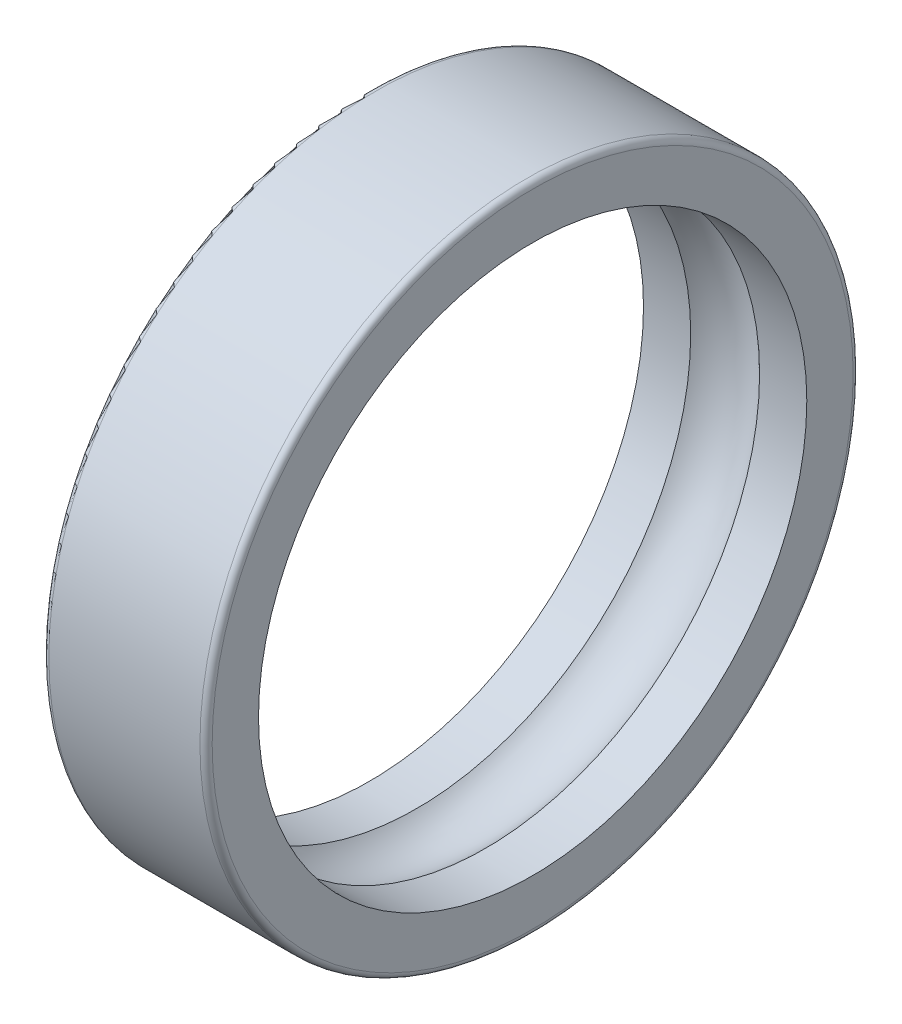
ISO-10303-21;
HEADER;
FILE_DESCRIPTION(('STEP AP214'),'2;1');
FILE_NAME('part.step','',(''),(''),'','','');
FILE_SCHEMA(('AUTOMOTIVE_DESIGN { 1 0 10303 214 1 1 1 1 }'));
ENDSEC;
DATA;
#1=APPLICATION_CONTEXT('core data for automotive mechanical design processes');
#2=APPLICATION_PROTOCOL_DEFINITION('international standard','automotive_design',2000,#1);
#3=PRODUCT_CONTEXT('',#1,'mechanical');
#4=PRODUCT('Part','Part','',(#3));
#5=PRODUCT_RELATED_PRODUCT_CATEGORY('part','',(#4));
#6=PRODUCT_DEFINITION_FORMATION('','',#4);
#7=PRODUCT_DEFINITION_CONTEXT('part definition',#1,'design');
#8=PRODUCT_DEFINITION('design','',#6,#7);
#9=PRODUCT_DEFINITION_SHAPE('','',#8);
#10=(LENGTH_UNIT() NAMED_UNIT(*) SI_UNIT(.MILLI.,.METRE.));
#11=(NAMED_UNIT(*) PLANE_ANGLE_UNIT() SI_UNIT($,.RADIAN.));
#12=(NAMED_UNIT(*) SI_UNIT($,.STERADIAN.) SOLID_ANGLE_UNIT());
#13=UNCERTAINTY_MEASURE_WITH_UNIT(LENGTH_MEASURE(1.E-05),#10,'distance_accuracy_value','');
#14=(GEOMETRIC_REPRESENTATION_CONTEXT(3) GLOBAL_UNCERTAINTY_ASSIGNED_CONTEXT((#13)) GLOBAL_UNIT_ASSIGNED_CONTEXT((#10,
#11,#12)) REPRESENTATION_CONTEXT('',''));
#15=CARTESIAN_POINT('',(0.,0.,0.));
#16=DIRECTION('',(0.,0.,1.));
#17=DIRECTION('',(1.,0.,0.));
#18=AXIS2_PLACEMENT_3D('',#15,#16,#17);
#19=CARTESIAN_POINT('',(4.,0.,0.));
#20=DIRECTION('',(1.,0.,0.));
#21=DIRECTION('',(0.,1.,0.));
#22=AXIS2_PLACEMENT_3D('',#19,#20,#21);
#23=TOROIDAL_SURFACE('',#22,11.75,2.381);
#24=CARTESIAN_POINT('',(5.68723422203313,0.,0.));
#25=DIRECTION('',(-1.,0.,0.));
#26=DIRECTION('',(0.,0.,1.));
#27=AXIS2_PLACEMENT_3D('',#24,#25,#26);
#28=CIRCLE('',#27,13.4300005);
#29=CARTESIAN_POINT('',(5.68723422203313,0.,13.4300005));
#30=VERTEX_POINT('',#29);
#31=EDGE_CURVE('E106',#30,#30,#28,.T.);
#32=ORIENTED_EDGE('',*,*,#31,.F.);
#33=EDGE_LOOP('',(#32));
#34=FACE_BOUND('',#33,.T.);
#35=CARTESIAN_POINT('',(2.31276577796687,0.,0.));
#36=DIRECTION('',(-1.,0.,0.));
#37=DIRECTION('',(0.,0.,1.));
#38=AXIS2_PLACEMENT_3D('',#35,#36,#37);
#39=CIRCLE('',#38,13.4300005);
#40=CARTESIAN_POINT('',(2.31276577796687,0.,13.4300005));
#41=VERTEX_POINT('',#40);
#42=EDGE_CURVE('E104',#41,#41,#39,.F.);
#43=ORIENTED_EDGE('',*,*,#42,.F.);
#44=EDGE_LOOP('',(#43));
#45=FACE_BOUND('',#44,.T.);
#46=ADVANCED_FACE('F14',(#34,#45),#23,.F.);
#47=CARTESIAN_POINT('',(5.68723422203313,0.,0.));
#48=DIRECTION('',(1.,0.,0.));
#49=DIRECTION('',(0.,0.,-1.));
#50=AXIS2_PLACEMENT_3D('',#47,#48,#49);
#51=CYLINDRICAL_SURFACE('',#50,13.4300005);
#52=ORIENTED_EDGE('',*,*,#31,.T.);
#53=EDGE_LOOP('',(#52));
#54=FACE_BOUND('',#53,.T.);
#55=CARTESIAN_POINT('',(8.,0.,0.));
#56=DIRECTION('',(1.,0.,0.));
#57=DIRECTION('',(0.,0.,-1.));
#58=AXIS2_PLACEMENT_3D('',#55,#56,#57);
#59=CIRCLE('',#58,13.4300005);
#60=CARTESIAN_POINT('',(8.,0.,-13.4300005));
#61=VERTEX_POINT('',#60);
#62=EDGE_CURVE('E18',#61,#61,#59,.F.);
#63=ORIENTED_EDGE('',*,*,#62,.F.);
#64=EDGE_LOOP('',(#63));
#65=FACE_BOUND('',#64,.T.);
#66=ADVANCED_FACE('F80',(#54,#65),#51,.F.);
#67=CARTESIAN_POINT('',(0.,0.,0.));
#68=DIRECTION('',(1.,0.,0.));
#69=DIRECTION('',(0.,0.,-1.));
#70=AXIS2_PLACEMENT_3D('',#67,#68,#69);
#71=CYLINDRICAL_SURFACE('',#70,13.4300005);
#72=CARTESIAN_POINT('',(0.,0.,0.));
#73=DIRECTION('',(1.,0.,0.));
#74=DIRECTION('',(0.,0.,-1.));
#75=AXIS2_PLACEMENT_3D('',#72,#73,#74);
#76=CIRCLE('',#75,13.4300005);
#77=CARTESIAN_POINT('',(0.,0.,-13.4300005));
#78=VERTEX_POINT('',#77);
#79=EDGE_CURVE('E99',#78,#78,#76,.T.);
#80=ORIENTED_EDGE('',*,*,#79,.F.);
#81=EDGE_LOOP('',(#80));
#82=FACE_BOUND('',#81,.T.);
#83=ORIENTED_EDGE('',*,*,#42,.T.);
#84=EDGE_LOOP('',(#83));
#85=FACE_BOUND('',#84,.T.);
#86=ADVANCED_FACE('F77',(#82,#85),#71,.F.);
#87=CARTESIAN_POINT('',(8.,0.,14.56500025));
#88=DIRECTION('',(1.,0.,0.));
#89=DIRECTION('',(0.,1.,0.));
#90=AXIS2_PLACEMENT_3D('',#87,#88,#89);
#91=PLANE('',#90);
#92=CARTESIAN_POINT('',(8.,0.,0.));
#93=DIRECTION('',(-1.,0.,0.));
#94=DIRECTION('',(0.,0.,1.));
#95=AXIS2_PLACEMENT_3D('',#92,#93,#94);
#96=CIRCLE('',#95,15.7);
#97=CARTESIAN_POINT('',(8.,0.,15.7));
#98=VERTEX_POINT('',#97);
#99=EDGE_CURVE('E61',#98,#98,#96,.T.);
#100=ORIENTED_EDGE('',*,*,#99,.F.);
#101=EDGE_LOOP('',(#100));
#102=FACE_BOUND('',#101,.T.);
#103=ORIENTED_EDGE('',*,*,#62,.T.);
#104=EDGE_LOOP('',(#103));
#105=FACE_BOUND('',#104,.T.);
#106=ADVANCED_FACE('F67',(#102,#105),#91,.T.);
#107=CARTESIAN_POINT('',(0.,0.,14.56500025));
#108=DIRECTION('',(-1.,0.,0.));
#109=DIRECTION('',(0.,0.,1.));
#110=AXIS2_PLACEMENT_3D('',#107,#108,#109);
#111=PLANE('',#110);
#112=ORIENTED_EDGE('',*,*,#79,.T.);
#113=EDGE_LOOP('',(#112));
#114=FACE_BOUND('',#113,.T.);
#115=CARTESIAN_POINT('',(0.,0.,0.));
#116=DIRECTION('',(1.,0.,0.));
#117=DIRECTION('',(0.,0.,1.));
#118=AXIS2_PLACEMENT_3D('',#115,#116,#117);
#119=CIRCLE('',#118,15.7);
#120=CARTESIAN_POINT('',(0.,0.,15.7));
#121=VERTEX_POINT('',#120);
#122=EDGE_CURVE('E27',#121,#121,#119,.T.);
#123=ORIENTED_EDGE('',*,*,#122,.F.);
#124=EDGE_LOOP('',(#123));
#125=FACE_BOUND('',#124,.T.);
#126=ADVANCED_FACE('F76',(#114,#125),#111,.T.);
#127=CARTESIAN_POINT('',(7.7,0.,0.));
#128=DIRECTION('',(1.,0.,0.));
#129=DIRECTION('',(0.,1.,0.));
#130=AXIS2_PLACEMENT_3D('',#127,#128,#129);
#131=TOROIDAL_SURFACE('',#130,15.7,0.299999999999997);
#132=CARTESIAN_POINT('',(7.7,0.,0.));
#133=DIRECTION('',(1.,0.,0.));
#134=DIRECTION('',(0.,0.,-1.));
#135=AXIS2_PLACEMENT_3D('',#132,#133,#134);
#136=CIRCLE('',#135,16.);
#137=CARTESIAN_POINT('',(7.7,0.,-16.));
#138=VERTEX_POINT('',#137);
#139=EDGE_CURVE('E22',#138,#138,#136,.F.);
#140=ORIENTED_EDGE('',*,*,#139,.F.);
#141=EDGE_LOOP('',(#140));
#142=FACE_BOUND('',#141,.T.);
#143=ORIENTED_EDGE('',*,*,#99,.T.);
#144=EDGE_LOOP('',(#143));
#145=FACE_BOUND('',#144,.T.);
#146=ADVANCED_FACE('F41',(#142,#145),#131,.T.);
#147=CARTESIAN_POINT('',(0.299999999999999,0.,0.));
#148=DIRECTION('',(1.,0.,0.));
#149=DIRECTION('',(0.,1.,0.));
#150=AXIS2_PLACEMENT_3D('',#147,#148,#149);
#151=TOROIDAL_SURFACE('',#150,15.7,0.299999999999999);
#152=ORIENTED_EDGE('',*,*,#122,.T.);
#153=EDGE_LOOP('',(#152));
#154=FACE_BOUND('',#153,.T.);
#155=CARTESIAN_POINT('',(0.3,0.,0.));
#156=DIRECTION('',(1.,0.,0.));
#157=DIRECTION('',(0.,0.,-1.));
#158=AXIS2_PLACEMENT_3D('',#155,#156,#157);
#159=CIRCLE('',#158,16.);
#160=CARTESIAN_POINT('',(0.3,0.,-16.));
#161=VERTEX_POINT('',#160);
#162=EDGE_CURVE('E10',#161,#161,#159,.T.);
#163=ORIENTED_EDGE('',*,*,#162,.F.);
#164=EDGE_LOOP('',(#163));
#165=FACE_BOUND('',#164,.T.);
#166=ADVANCED_FACE('F35',(#154,#165),#151,.T.);
#167=CARTESIAN_POINT('',(4.,0.,0.));
#168=DIRECTION('',(1.,0.,0.));
#169=DIRECTION('',(0.,0.,-1.));
#170=AXIS2_PLACEMENT_3D('',#167,#168,#169);
#171=CYLINDRICAL_SURFACE('',#170,16.);
#172=ORIENTED_EDGE('',*,*,#139,.T.);
#173=EDGE_LOOP('',(#172));
#174=FACE_BOUND('',#173,.T.);
#175=ORIENTED_EDGE('',*,*,#162,.T.);
#176=EDGE_LOOP('',(#175));
#177=FACE_BOUND('',#176,.T.);
#178=ADVANCED_FACE('F40',(#174,#177),#171,.T.);
#179=CLOSED_SHELL('',(#46,#66,#86,#106,#126,#146,#166,#178));
#180=MANIFOLD_SOLID_BREP('B1',#179);
#181=ADVANCED_BREP_SHAPE_REPRESENTATION('',(#18,#180),#14);
#182=SHAPE_DEFINITION_REPRESENTATION(#9,#181);
ENDSEC;
END-ISO-10303-21;
